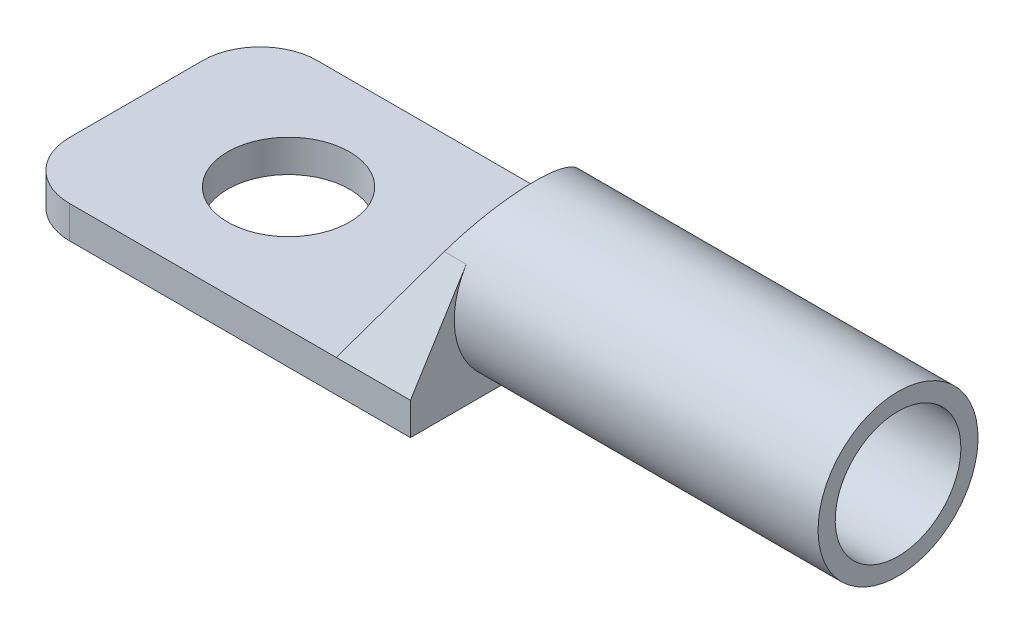
ISO-10303-21;
HEADER;
FILE_DESCRIPTION(('STEP AP214'),'2;1');
FILE_NAME('part.step','',(''),(''),'','','');
FILE_SCHEMA(('AUTOMOTIVE_DESIGN { 1 0 10303 214 1 1 1 1 }'));
ENDSEC;
DATA;
#1=APPLICATION_CONTEXT('core data for automotive mechanical design processes');
#2=APPLICATION_PROTOCOL_DEFINITION('international standard','automotive_design',2000,#1);
#3=PRODUCT_CONTEXT('',#1,'mechanical');
#4=PRODUCT('Part','Part','',(#3));
#5=PRODUCT_RELATED_PRODUCT_CATEGORY('part','',(#4));
#6=PRODUCT_DEFINITION_FORMATION('','',#4);
#7=PRODUCT_DEFINITION_CONTEXT('part definition',#1,'design');
#8=PRODUCT_DEFINITION('design','',#6,#7);
#9=PRODUCT_DEFINITION_SHAPE('','',#8);
#10=(LENGTH_UNIT() NAMED_UNIT(*) SI_UNIT(.MILLI.,.METRE.));
#11=(NAMED_UNIT(*) PLANE_ANGLE_UNIT() SI_UNIT($,.RADIAN.));
#12=(NAMED_UNIT(*) SI_UNIT($,.STERADIAN.) SOLID_ANGLE_UNIT());
#13=UNCERTAINTY_MEASURE_WITH_UNIT(LENGTH_MEASURE(1.E-05),#10,'distance_accuracy_value','');
#14=(GEOMETRIC_REPRESENTATION_CONTEXT(3) GLOBAL_UNCERTAINTY_ASSIGNED_CONTEXT((#13)) GLOBAL_UNIT_ASSIGNED_CONTEXT((#10,
#11,#12)) REPRESENTATION_CONTEXT('',''));
#15=CARTESIAN_POINT('',(0.,0.,0.));
#16=DIRECTION('',(0.,0.,1.));
#17=DIRECTION('',(1.,0.,0.));
#18=AXIS2_PLACEMENT_3D('',#15,#16,#17);
#19=CARTESIAN_POINT('',(20.9,6.5,6.5));
#20=DIRECTION('',(1.,0.,0.));
#21=DIRECTION('',(0.,1.,0.));
#22=AXIS2_PLACEMENT_3D('',#19,#20,#21);
#23=PLANE('',#22);
#24=DIRECTION('',(0.,0.527994421274225,-0.849247838444877));
#25=VECTOR('',#24,1.);
#26=CARTESIAN_POINT('',(20.9,6.5,6.5));
#27=LINE('',#26,#25);
#28=CARTESIAN_POINT('',(20.9,8.71757656935175,2.93315907853152));
#29=VERTEX_POINT('',#28);
#30=CARTESIAN_POINT('',(20.9,8.71764251411582,2.93305301027381));
#31=VERTEX_POINT('',#30);
#32=EDGE_CURVE('E133',#29,#31,#27,.T.);
#33=ORIENTED_EDGE('',*,*,#32,.F.);
#34=CARTESIAN_POINT('',(20.9,6.50000000000001,6.5));
#35=DIRECTION('',(1.,0.,0.));
#36=DIRECTION('',(0.,1.,0.));
#37=AXIS2_PLACEMENT_3D('',#34,#35,#36);
#38=CIRCLE('',#37,4.2);
#39=CARTESIAN_POINT('',(20.9,2.3,6.5));
#40=VERTEX_POINT('',#39);
#41=EDGE_CURVE('E143',#40,#29,#38,.T.);
#42=ORIENTED_EDGE('',*,*,#41,.F.);
#43=DIRECTION('',(0.,0.,1.));
#44=VECTOR('',#43,1.);
#45=CARTESIAN_POINT('',(20.9,2.3,13.));
#46=LINE('',#45,#44);
#47=CARTESIAN_POINT('',(20.9,2.3,0.));
#48=VERTEX_POINT('',#47);
#49=EDGE_CURVE('E207',#48,#40,#46,.T.);
#50=ORIENTED_EDGE('',*,*,#49,.F.);
#51=DIRECTION('',(0.,-1.,0.));
#52=VECTOR('',#51,1.);
#53=CARTESIAN_POINT('',(20.9,0.,0.));
#54=LINE('',#53,#52);
#55=CARTESIAN_POINT('',(20.9,3.99999999999999,0.));
#56=VERTEX_POINT('',#55);
#57=EDGE_CURVE('E228',#56,#48,#54,.T.);
#58=ORIENTED_EDGE('',*,*,#57,.F.);
#59=DIRECTION('',(0.,-0.849247838444877,-0.527994421274225));
#60=VECTOR('',#59,1.);
#61=CARTESIAN_POINT('',(20.9,3.99999999999999,0.));
#62=LINE('',#61,#60);
#63=EDGE_CURVE('E243',#31,#56,#62,.T.);
#64=ORIENTED_EDGE('',*,*,#63,.F.);
#65=EDGE_LOOP('',(#33,#42,#50,#58,#64));
#66=FACE_BOUND('',#65,.T.);
#67=ADVANCED_FACE('F36',(#66),#23,.T.);
#68=CARTESIAN_POINT('',(40.,13.,13.));
#69=DIRECTION('',(-1.,0.,0.));
#70=DIRECTION('',(0.,-1.,0.));
#71=AXIS2_PLACEMENT_3D('',#68,#69,#70);
#72=PLANE('',#71);
#73=CARTESIAN_POINT('',(40.,6.5,6.5));
#74=DIRECTION('',(1.,0.,0.));
#75=DIRECTION('',(0.,1.,0.));
#76=AXIS2_PLACEMENT_3D('',#73,#74,#75);
#77=CIRCLE('',#76,3.3);
#78=CARTESIAN_POINT('',(40.,9.8,6.5));
#79=VERTEX_POINT('',#78);
#80=EDGE_CURVE('E229',#79,#79,#77,.T.);
#81=ORIENTED_EDGE('',*,*,#80,.F.);
#82=EDGE_LOOP('',(#81));
#83=FACE_BOUND('',#82,.T.);
#84=CARTESIAN_POINT('',(40.,6.5,6.5));
#85=DIRECTION('',(1.,0.,0.));
#86=DIRECTION('',(0.,1.,0.));
#87=AXIS2_PLACEMENT_3D('',#84,#85,#86);
#88=CIRCLE('',#87,4.2);
#89=CARTESIAN_POINT('',(40.,10.7,6.5));
#90=VERTEX_POINT('',#89);
#91=EDGE_CURVE('E214',#90,#90,#88,.T.);
#92=ORIENTED_EDGE('',*,*,#91,.T.);
#93=EDGE_LOOP('',(#92));
#94=FACE_BOUND('',#93,.T.);
#95=ADVANCED_FACE('F275',(#83,#94),#72,.F.);
#96=CARTESIAN_POINT('',(23.,6.5,6.5));
#97=DIRECTION('',(1.,0.,0.));
#98=DIRECTION('',(0.,1.,0.));
#99=AXIS2_PLACEMENT_3D('',#96,#97,#98);
#100=CYLINDRICAL_SURFACE('',#99,3.3);
#101=CARTESIAN_POINT('',(23.,6.5,6.5));
#102=DIRECTION('',(1.,0.,0.));
#103=DIRECTION('',(0.,1.,0.));
#104=AXIS2_PLACEMENT_3D('',#101,#102,#103);
#105=CIRCLE('',#104,3.3);
#106=CARTESIAN_POINT('',(23.,9.8,6.5));
#107=VERTEX_POINT('',#106);
#108=EDGE_CURVE('E225',#107,#107,#105,.T.);
#109=ORIENTED_EDGE('',*,*,#108,.F.);
#110=EDGE_LOOP('',(#109));
#111=FACE_BOUND('',#110,.T.);
#112=ORIENTED_EDGE('',*,*,#80,.T.);
#113=EDGE_LOOP('',(#112));
#114=FACE_BOUND('',#113,.T.);
#115=ADVANCED_FACE('F280',(#111,#114),#100,.F.);
#116=CARTESIAN_POINT('',(23.,6.5,6.5));
#117=DIRECTION('',(1.,0.,0.));
#118=DIRECTION('',(0.,1.,0.));
#119=AXIS2_PLACEMENT_3D('',#116,#117,#118);
#120=PLANE('',#119);
#121=ORIENTED_EDGE('',*,*,#108,.T.);
#122=EDGE_LOOP('',(#121));
#123=FACE_BOUND('',#122,.T.);
#124=ADVANCED_FACE('F286',(#123),#120,.T.);
#125=DIRECTION('',(0.,-0.528009154243828,-0.849238678484864));
#126=VECTOR('',#125,1.);
#127=CARTESIAN_POINT('',(20.9,6.5,6.5));
#128=LINE('',#127,#126);
#129=CARTESIAN_POINT('',(20.9,8.7176535090434,10.0668266737808));
#130=VERTEX_POINT('',#129);
#131=CARTESIAN_POINT('',(20.9,8.71763844782408,10.0668024496364));
#132=VERTEX_POINT('',#131);
#133=EDGE_CURVE('E249',#130,#132,#128,.T.);
#134=ORIENTED_EDGE('',*,*,#133,.F.);
#135=DIRECTION('',(0.,0.849238678484864,-0.528009154243827));
#136=VECTOR('',#135,1.);
#137=CARTESIAN_POINT('',(20.9,3.99999999999999,13.));
#138=LINE('',#137,#136);
#139=CARTESIAN_POINT('',(20.9,3.99999999999999,13.));
#140=VERTEX_POINT('',#139);
#141=EDGE_CURVE('E203',#140,#130,#138,.T.);
#142=ORIENTED_EDGE('',*,*,#141,.F.);
#143=DIRECTION('',(0.,-1.,0.));
#144=VECTOR('',#143,1.);
#145=CARTESIAN_POINT('',(20.9,0.,13.));
#146=LINE('',#145,#144);
#147=CARTESIAN_POINT('',(20.9,2.3,13.));
#148=VERTEX_POINT('',#147);
#149=EDGE_CURVE('E187',#140,#148,#146,.T.);
#150=ORIENTED_EDGE('',*,*,#149,.T.);
#151=EDGE_CURVE('E201',#40,#148,#46,.T.);
#152=ORIENTED_EDGE('',*,*,#151,.F.);
#153=EDGE_CURVE('E215',#132,#40,#38,.T.);
#154=ORIENTED_EDGE('',*,*,#153,.F.);
#155=EDGE_LOOP('',(#134,#142,#150,#152,#154));
#156=FACE_BOUND('',#155,.T.);
#157=ADVANCED_FACE('F260',(#156),#23,.T.);
#158=CARTESIAN_POINT('',(20.9,6.50000000000001,6.5));
#159=DIRECTION('',(1.,0.,0.));
#160=DIRECTION('',(0.,1.,0.));
#161=AXIS2_PLACEMENT_3D('',#158,#159,#160);
#162=CYLINDRICAL_SURFACE('',#161,4.2);
#163=ORIENTED_EDGE('',*,*,#91,.F.);
#164=EDGE_LOOP('',(#163));
#165=FACE_BOUND('',#164,.T.);
#166=ORIENTED_EDGE('',*,*,#41,.T.);
#167=DIRECTION('',(1.,0.,0.));
#168=VECTOR('',#167,1.);
#169=CARTESIAN_POINT('',(7.7,8.71757656935176,2.93315907853152));
#170=LINE('',#169,#168);
#171=CARTESIAN_POINT('',(19.7460520329062,8.71757656935175,2.93315907853152));
#172=VERTEX_POINT('',#171);
#173=EDGE_CURVE('E126',#172,#29,#170,.T.);
#174=ORIENTED_EDGE('',*,*,#173,.F.);
#175=CARTESIAN_POINT('',(18.455223880597,6.50000000000001,6.5));
#176=DIRECTION('',(0.864246375176079,-0.503068785550254,0.));
#177=DIRECTION('',(0.503068785550254,0.864246375176079,0.));
#178=AXIS2_PLACEMENT_3D('',#175,#176,#177);
#179=ELLIPSE('',#178,4.85972532906985,4.2);
#180=CARTESIAN_POINT('',(19.7460880517185,8.71763844782408,10.0668024496364));
#181=VERTEX_POINT('',#180);
#182=EDGE_CURVE('E140',#181,#172,#179,.F.);
#183=ORIENTED_EDGE('',*,*,#182,.F.);
#184=DIRECTION('',(1.,0.,0.));
#185=VECTOR('',#184,1.);
#186=CARTESIAN_POINT('',(7.7,8.71763844782409,10.0668024496364));
#187=LINE('',#186,#185);
#188=EDGE_CURVE('E134',#181,#132,#187,.T.);
#189=ORIENTED_EDGE('',*,*,#188,.T.);
#190=ORIENTED_EDGE('',*,*,#153,.T.);
#191=EDGE_LOOP('',(#166,#174,#183,#189,#190));
#192=FACE_BOUND('',#191,.T.);
#193=ADVANCED_FACE('F138',(#165,#192),#162,.T.);
#194=CARTESIAN_POINT('',(8.,-6.,6.5));
#195=DIRECTION('',(0.,1.,0.));
#196=DIRECTION('',(0.,0.,1.));
#197=AXIS2_PLACEMENT_3D('',#194,#195,#196);
#198=CYLINDRICAL_SURFACE('',#197,3.2);
#199=CARTESIAN_POINT('',(8.,2.3,6.5));
#200=DIRECTION('',(0.,1.,0.));
#201=DIRECTION('',(-1.,0.,0.));
#202=AXIS2_PLACEMENT_3D('',#199,#200,#201);
#203=CIRCLE('',#202,3.2);
#204=CARTESIAN_POINT('',(4.8,2.3,6.5));
#205=VERTEX_POINT('',#204);
#206=EDGE_CURVE('E211',#205,#205,#203,.F.);
#207=ORIENTED_EDGE('',*,*,#206,.T.);
#208=EDGE_LOOP('',(#207));
#209=FACE_BOUND('',#208,.T.);
#210=CARTESIAN_POINT('',(8.,4.,6.5));
#211=DIRECTION('',(0.,-1.,0.));
#212=DIRECTION('',(0.,0.,-1.));
#213=AXIS2_PLACEMENT_3D('',#210,#211,#212);
#214=CIRCLE('',#213,3.2);
#215=CARTESIAN_POINT('',(8.,4.,3.3));
#216=VERTEX_POINT('',#215);
#217=EDGE_CURVE('E224',#216,#216,#214,.F.);
#218=ORIENTED_EDGE('',*,*,#217,.T.);
#219=EDGE_LOOP('',(#218));
#220=FACE_BOUND('',#219,.T.);
#221=ADVANCED_FACE('F291',(#209,#220),#198,.F.);
#222=CARTESIAN_POINT('',(0.,4.,0.));
#223=DIRECTION('',(0.,-1.,0.));
#224=DIRECTION('',(0.,0.,-1.));
#225=AXIS2_PLACEMENT_3D('',#222,#223,#224);
#226=PLANE('',#225);
#227=DIRECTION('',(0.,0.,1.));
#228=VECTOR('',#227,1.);
#229=CARTESIAN_POINT('',(0.,4.,13.));
#230=LINE('',#229,#228);
#231=CARTESIAN_POINT('',(0.,4.,3.));
#232=VERTEX_POINT('',#231);
#233=CARTESIAN_POINT('',(0.,4.,10.));
#234=VERTEX_POINT('',#233);
#235=EDGE_CURVE('E175',#232,#234,#230,.T.);
#236=ORIENTED_EDGE('',*,*,#235,.T.);
#237=CARTESIAN_POINT('',(3.,4.,10.));
#238=DIRECTION('',(0.,-1.,0.));
#239=DIRECTION('',(0.,0.,-1.));
#240=AXIS2_PLACEMENT_3D('',#237,#238,#239);
#241=CIRCLE('',#240,3.);
#242=CARTESIAN_POINT('',(3.,4.,13.));
#243=VERTEX_POINT('',#242);
#244=EDGE_CURVE('E44',#234,#243,#241,.F.);
#245=ORIENTED_EDGE('',*,*,#244,.T.);
#246=DIRECTION('',(1.,0.,0.));
#247=VECTOR('',#246,1.);
#248=CARTESIAN_POINT('',(17.,4.,13.));
#249=LINE('',#248,#247);
#250=CARTESIAN_POINT('',(17.,3.99999999999999,13.));
#251=VERTEX_POINT('',#250);
#252=EDGE_CURVE('E173',#243,#251,#249,.T.);
#253=ORIENTED_EDGE('',*,*,#252,.T.);
#254=DIRECTION('',(0.,0.,-1.));
#255=VECTOR('',#254,1.);
#256=CARTESIAN_POINT('',(17.,4.,13.));
#257=LINE('',#256,#255);
#258=CARTESIAN_POINT('',(17.,4.,0.));
#259=VERTEX_POINT('',#258);
#260=EDGE_CURVE('E186',#251,#259,#257,.T.);
#261=ORIENTED_EDGE('',*,*,#260,.T.);
#262=DIRECTION('',(-1.,0.,0.));
#263=VECTOR('',#262,1.);
#264=CARTESIAN_POINT('',(0.,4.,0.));
#265=LINE('',#264,#263);
#266=CARTESIAN_POINT('',(3.,4.,0.));
#267=VERTEX_POINT('',#266);
#268=EDGE_CURVE('E221',#259,#267,#265,.T.);
#269=ORIENTED_EDGE('',*,*,#268,.T.);
#270=CARTESIAN_POINT('',(3.,4.,3.));
#271=DIRECTION('',(0.,-1.,0.));
#272=DIRECTION('',(0.,0.,-1.));
#273=AXIS2_PLACEMENT_3D('',#270,#271,#272);
#274=CIRCLE('',#273,3.);
#275=EDGE_CURVE('E166',#267,#232,#274,.F.);
#276=ORIENTED_EDGE('',*,*,#275,.T.);
#277=EDGE_LOOP('',(#236,#245,#253,#261,#269,#276));
#278=FACE_BOUND('',#277,.T.);
#279=ORIENTED_EDGE('',*,*,#217,.F.);
#280=EDGE_LOOP('',(#279));
#281=FACE_BOUND('',#280,.T.);
#282=ADVANCED_FACE('F170',(#278,#281),#226,.F.);
#283=CARTESIAN_POINT('',(0.,0.,13.));
#284=DIRECTION('',(1.,0.,0.));
#285=DIRECTION('',(0.,0.,-1.));
#286=AXIS2_PLACEMENT_3D('',#283,#284,#285);
#287=PLANE('',#286);
#288=DIRECTION('',(0.,0.,-1.));
#289=VECTOR('',#288,1.);
#290=CARTESIAN_POINT('',(0.,2.3,0.));
#291=LINE('',#290,#289);
#292=CARTESIAN_POINT('',(0.,2.3,9.99999999999999));
#293=VERTEX_POINT('',#292);
#294=CARTESIAN_POINT('',(0.,2.3,3.));
#295=VERTEX_POINT('',#294);
#296=EDGE_CURVE('E194',#293,#295,#291,.T.);
#297=ORIENTED_EDGE('',*,*,#296,.F.);
#298=DIRECTION('',(0.,-1.,0.));
#299=VECTOR('',#298,1.);
#300=CARTESIAN_POINT('',(0.,0.,10.));
#301=LINE('',#300,#299);
#302=EDGE_CURVE('E57',#293,#234,#301,.F.);
#303=ORIENTED_EDGE('',*,*,#302,.T.);
#304=ORIENTED_EDGE('',*,*,#235,.F.);
#305=DIRECTION('',(0.,-1.,0.));
#306=VECTOR('',#305,1.);
#307=CARTESIAN_POINT('',(0.,2.3,3.));
#308=LINE('',#307,#306);
#309=EDGE_CURVE('E162',#232,#295,#308,.T.);
#310=ORIENTED_EDGE('',*,*,#309,.T.);
#311=EDGE_LOOP('',(#297,#303,#304,#310));
#312=FACE_BOUND('',#311,.T.);
#313=ADVANCED_FACE('F197',(#312),#287,.F.);
#314=CARTESIAN_POINT('',(0.,0.,13.));
#315=DIRECTION('',(0.,0.,-1.));
#316=DIRECTION('',(-1.,0.,0.));
#317=AXIS2_PLACEMENT_3D('',#314,#315,#316);
#318=PLANE('',#317);
#319=ORIENTED_EDGE('',*,*,#252,.F.);
#320=DIRECTION('',(0.,-1.,0.));
#321=VECTOR('',#320,1.);
#322=CARTESIAN_POINT('',(3.,0.,13.));
#323=LINE('',#322,#321);
#324=CARTESIAN_POINT('',(3.,2.3,13.));
#325=VERTEX_POINT('',#324);
#326=EDGE_CURVE('E149',#243,#325,#323,.T.);
#327=ORIENTED_EDGE('',*,*,#326,.T.);
#328=DIRECTION('',(-1.,0.,0.));
#329=VECTOR('',#328,1.);
#330=CARTESIAN_POINT('',(0.,2.3,13.));
#331=LINE('',#330,#329);
#332=EDGE_CURVE('E196',#148,#325,#331,.T.);
#333=ORIENTED_EDGE('',*,*,#332,.F.);
#334=ORIENTED_EDGE('',*,*,#149,.F.);
#335=DIRECTION('',(1.,0.,0.));
#336=VECTOR('',#335,1.);
#337=CARTESIAN_POINT('',(-1.40000000000001,4.,13.));
#338=LINE('',#337,#336);
#339=EDGE_CURVE('E184',#251,#140,#338,.T.);
#340=ORIENTED_EDGE('',*,*,#339,.F.);
#341=EDGE_LOOP('',(#319,#327,#333,#334,#340));
#342=FACE_BOUND('',#341,.T.);
#343=ADVANCED_FACE('F180',(#342),#318,.F.);
#344=CARTESIAN_POINT('',(0.,0.,0.));
#345=DIRECTION('',(0.,0.,-1.));
#346=DIRECTION('',(-1.,0.,0.));
#347=AXIS2_PLACEMENT_3D('',#344,#345,#346);
#348=PLANE('',#347);
#349=DIRECTION('',(1.,0.,0.));
#350=VECTOR('',#349,1.);
#351=CARTESIAN_POINT('',(20.9,2.3,0.));
#352=LINE('',#351,#350);
#353=CARTESIAN_POINT('',(3.,2.3,0.));
#354=VERTEX_POINT('',#353);
#355=EDGE_CURVE('E199',#354,#48,#352,.T.);
#356=ORIENTED_EDGE('',*,*,#355,.F.);
#357=DIRECTION('',(0.,-1.,0.));
#358=VECTOR('',#357,1.);
#359=CARTESIAN_POINT('',(3.,4.,0.));
#360=LINE('',#359,#358);
#361=EDGE_CURVE('E12',#354,#267,#360,.F.);
#362=ORIENTED_EDGE('',*,*,#361,.T.);
#363=ORIENTED_EDGE('',*,*,#268,.F.);
#364=DIRECTION('',(1.,0.,0.));
#365=VECTOR('',#364,1.);
#366=CARTESIAN_POINT('',(-1.40000000000001,4.,0.));
#367=LINE('',#366,#365);
#368=EDGE_CURVE('E248',#259,#56,#367,.T.);
#369=ORIENTED_EDGE('',*,*,#368,.T.);
#370=ORIENTED_EDGE('',*,*,#57,.T.);
#371=EDGE_LOOP('',(#356,#362,#363,#369,#370));
#372=FACE_BOUND('',#371,.T.);
#373=ADVANCED_FACE('F267',(#372),#348,.T.);
#374=CARTESIAN_POINT('',(0.,2.3,0.));
#375=DIRECTION('',(0.,1.,0.));
#376=DIRECTION('',(-1.,0.,0.));
#377=AXIS2_PLACEMENT_3D('',#374,#375,#376);
#378=PLANE('',#377);
#379=ORIENTED_EDGE('',*,*,#332,.T.);
#380=CARTESIAN_POINT('',(3.,2.3,10.));
#381=DIRECTION('',(0.,1.,0.));
#382=DIRECTION('',(-1.,0.,0.));
#383=AXIS2_PLACEMENT_3D('',#380,#381,#382);
#384=CIRCLE('',#383,3.);
#385=EDGE_CURVE('E160',#325,#293,#384,.F.);
#386=ORIENTED_EDGE('',*,*,#385,.T.);
#387=ORIENTED_EDGE('',*,*,#296,.T.);
#388=CARTESIAN_POINT('',(3.,2.3,3.));
#389=DIRECTION('',(0.,1.,0.));
#390=DIRECTION('',(-1.,0.,0.));
#391=AXIS2_PLACEMENT_3D('',#388,#389,#390);
#392=CIRCLE('',#391,3.);
#393=EDGE_CURVE('E153',#295,#354,#392,.F.);
#394=ORIENTED_EDGE('',*,*,#393,.T.);
#395=ORIENTED_EDGE('',*,*,#355,.T.);
#396=ORIENTED_EDGE('',*,*,#49,.T.);
#397=ORIENTED_EDGE('',*,*,#151,.T.);
#398=EDGE_LOOP('',(#379,#386,#387,#394,#395,#396,#397));
#399=FACE_BOUND('',#398,.T.);
#400=ORIENTED_EDGE('',*,*,#206,.F.);
#401=EDGE_LOOP('',(#400));
#402=FACE_BOUND('',#401,.T.);
#403=ADVANCED_FACE('F192',(#399,#402),#378,.F.);
#404=CARTESIAN_POINT('',(20.9,10.7,-9.3));
#405=DIRECTION('',(0.864246375176079,-0.503068785550254,0.));
#406=DIRECTION('',(0.503068785550254,0.864246375176079,0.));
#407=AXIS2_PLACEMENT_3D('',#404,#405,#406);
#408=PLANE('',#407);
#409=DIRECTION('',(0.443144805596386,0.761300050639947,-0.473333829520514));
#410=VECTOR('',#409,1.);
#411=CARTESIAN_POINT('',(24.7037708761335,17.2346833000242,4.77141348719758));
#412=LINE('',#411,#410);
#413=CARTESIAN_POINT('',(19.7460968186969,8.7176535090434,10.0668266737808));
#414=VERTEX_POINT('',#413);
#415=EDGE_CURVE('E236',#251,#414,#412,.T.);
#416=ORIENTED_EDGE('',*,*,#415,.T.);
#417=DIRECTION('',(-0.293785718945674,-0.504708799214364,-0.811762883691517));
#418=VECTOR('',#417,1.);
#419=CARTESIAN_POINT('',(15.5209402137456,1.45905113643468,-1.60775479325704));
#420=LINE('',#419,#418);
#421=EDGE_CURVE('E148',#414,#181,#420,.T.);
#422=ORIENTED_EDGE('',*,*,#421,.T.);
#423=ORIENTED_EDGE('',*,*,#182,.T.);
#424=DIRECTION('',(0.293778228978076,0.504695931834132,-0.811773594402148));
#425=VECTOR('',#424,1.);
#426=CARTESIAN_POINT('',(23.0569565714078,14.4055407765211,-6.21559536556433));
#427=LINE('',#426,#425);
#428=CARTESIAN_POINT('',(19.7460904186644,8.71764251411582,2.9330530102738));
#429=VERTEX_POINT('',#428);
#430=EDGE_CURVE('E123',#172,#429,#427,.T.);
#431=ORIENTED_EDGE('',*,*,#430,.T.);
#432=DIRECTION('',(-0.443148646737663,-0.76130664952368,-0.473319619586603));
#433=VECTOR('',#432,1.);
#434=CARTESIAN_POINT('',(18.0755934723702,5.84781442689235,1.1488233054979));
#435=LINE('',#434,#433);
#436=EDGE_CURVE('E238',#429,#259,#435,.T.);
#437=ORIENTED_EDGE('',*,*,#436,.T.);
#438=ORIENTED_EDGE('',*,*,#260,.F.);
#439=EDGE_LOOP('',(#416,#422,#423,#431,#437,#438));
#440=FACE_BOUND('',#439,.T.);
#441=ADVANCED_FACE('F147',(#440),#408,.F.);
#442=CARTESIAN_POINT('',(-1.40000000000001,4.,13.));
#443=DIRECTION('',(0.,-0.528009154243827,-0.849238678484864));
#444=DIRECTION('',(0.,0.849238678484864,-0.528009154243827));
#445=AXIS2_PLACEMENT_3D('',#442,#443,#444);
#446=PLANE('',#445);
#447=ORIENTED_EDGE('',*,*,#141,.T.);
#448=DIRECTION('',(-1.,0.,0.));
#449=VECTOR('',#448,1.);
#450=CARTESIAN_POINT('',(-1.40000000000001,8.71765350904341,10.0668266737808));
#451=LINE('',#450,#449);
#452=EDGE_CURVE('E150',#130,#414,#451,.T.);
#453=ORIENTED_EDGE('',*,*,#452,.T.);
#454=ORIENTED_EDGE('',*,*,#415,.F.);
#455=ORIENTED_EDGE('',*,*,#339,.T.);
#456=EDGE_LOOP('',(#447,#453,#454,#455));
#457=FACE_BOUND('',#456,.T.);
#458=ADVANCED_FACE('F257',(#457),#446,.F.);
#459=CARTESIAN_POINT('',(-1.40000000000001,4.,0.));
#460=DIRECTION('',(0.,-0.527994421274225,0.849247838444877));
#461=DIRECTION('',(0.,-0.849247838444877,-0.527994421274225));
#462=AXIS2_PLACEMENT_3D('',#459,#460,#461);
#463=PLANE('',#462);
#464=ORIENTED_EDGE('',*,*,#436,.F.);
#465=DIRECTION('',(1.,0.,0.));
#466=VECTOR('',#465,1.);
#467=CARTESIAN_POINT('',(-1.40000000000001,8.71764251411584,2.93305301027381));
#468=LINE('',#467,#466);
#469=EDGE_CURVE('E129',#429,#31,#468,.T.);
#470=ORIENTED_EDGE('',*,*,#469,.T.);
#471=ORIENTED_EDGE('',*,*,#63,.T.);
#472=ORIENTED_EDGE('',*,*,#368,.F.);
#473=EDGE_LOOP('',(#464,#470,#471,#472));
#474=FACE_BOUND('',#473,.T.);
#475=ADVANCED_FACE('F241',(#474),#463,.F.);
#476=CARTESIAN_POINT('',(7.7,8.71757656935176,2.93315907853152));
#477=DIRECTION('',(0.,-0.849247838444877,-0.527994421274225));
#478=DIRECTION('',(0.,0.527994421274225,-0.849247838444877));
#479=AXIS2_PLACEMENT_3D('',#476,#477,#478);
#480=PLANE('',#479);
#481=ORIENTED_EDGE('',*,*,#32,.T.);
#482=ORIENTED_EDGE('',*,*,#469,.F.);
#483=ORIENTED_EDGE('',*,*,#430,.F.);
#484=ORIENTED_EDGE('',*,*,#173,.T.);
#485=EDGE_LOOP('',(#481,#482,#483,#484));
#486=FACE_BOUND('',#485,.T.);
#487=ADVANCED_FACE('F125',(#486),#480,.F.);
#488=CARTESIAN_POINT('',(7.7,8.71763844782409,10.0668024496364));
#489=DIRECTION('',(0.,-0.849238678484864,0.528009154243828));
#490=DIRECTION('',(0.,-0.528009154243828,-0.849238678484864));
#491=AXIS2_PLACEMENT_3D('',#488,#489,#490);
#492=PLANE('',#491);
#493=ORIENTED_EDGE('',*,*,#133,.T.);
#494=ORIENTED_EDGE('',*,*,#188,.F.);
#495=ORIENTED_EDGE('',*,*,#421,.F.);
#496=ORIENTED_EDGE('',*,*,#452,.F.);
#497=EDGE_LOOP('',(#493,#494,#495,#496));
#498=FACE_BOUND('',#497,.T.);
#499=ADVANCED_FACE('F264',(#498),#492,.F.);
#500=CARTESIAN_POINT('',(3.,0.,10.));
#501=DIRECTION('',(0.,-1.,0.));
#502=DIRECTION('',(0.,0.,-1.));
#503=AXIS2_PLACEMENT_3D('',#500,#501,#502);
#504=CYLINDRICAL_SURFACE('',#503,3.);
#505=ORIENTED_EDGE('',*,*,#244,.F.);
#506=ORIENTED_EDGE('',*,*,#302,.F.);
#507=ORIENTED_EDGE('',*,*,#385,.F.);
#508=ORIENTED_EDGE('',*,*,#326,.F.);
#509=EDGE_LOOP('',(#505,#506,#507,#508));
#510=FACE_BOUND('',#509,.T.);
#511=ADVANCED_FACE('F189',(#510),#504,.T.);
#512=CARTESIAN_POINT('',(3.,0.,3.));
#513=DIRECTION('',(0.,1.,0.));
#514=DIRECTION('',(0.,0.,1.));
#515=AXIS2_PLACEMENT_3D('',#512,#513,#514);
#516=CYLINDRICAL_SURFACE('',#515,3.);
#517=ORIENTED_EDGE('',*,*,#275,.F.);
#518=ORIENTED_EDGE('',*,*,#361,.F.);
#519=ORIENTED_EDGE('',*,*,#393,.F.);
#520=ORIENTED_EDGE('',*,*,#309,.F.);
#521=EDGE_LOOP('',(#517,#518,#519,#520));
#522=FACE_BOUND('',#521,.T.);
#523=ADVANCED_FACE('F38',(#522),#516,.T.);
#524=CLOSED_SHELL('',(#67,#95,#115,#124,#157,#193,#221,#282,#313,#343,#373,#403,#441,#458,#475,
#487,#499,#511,#523));
#525=MANIFOLD_SOLID_BREP('B2',#524);
#526=ADVANCED_BREP_SHAPE_REPRESENTATION('',(#18,#525),#14);
#527=SHAPE_DEFINITION_REPRESENTATION(#9,#526);
ENDSEC;
END-ISO-10303-21;
